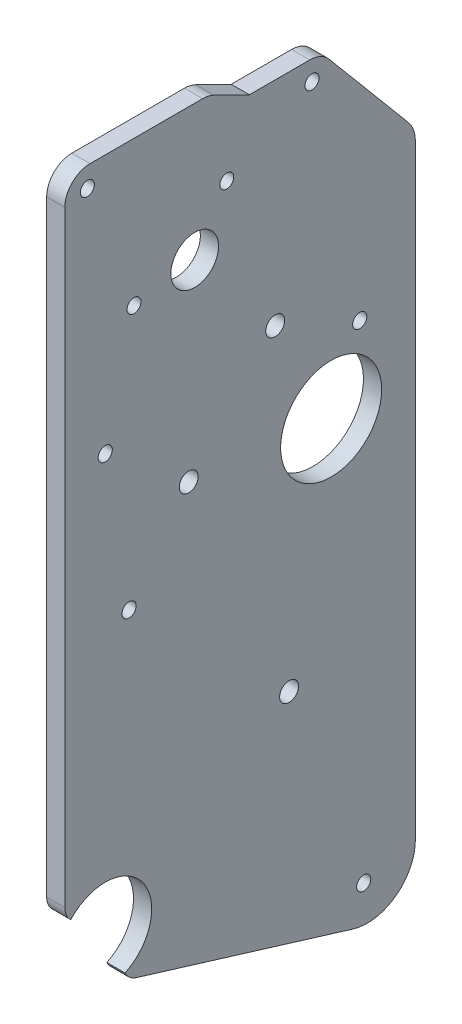
ISO-10303-21;
HEADER;
FILE_DESCRIPTION(('STEP AP214'),'2;1');
FILE_NAME('part.step','',(''),(''),'','','');
FILE_SCHEMA(('AUTOMOTIVE_DESIGN { 1 0 10303 214 1 1 1 1 }'));
ENDSEC;
DATA;
#1=APPLICATION_CONTEXT('core data for automotive mechanical design processes');
#2=APPLICATION_PROTOCOL_DEFINITION('international standard','automotive_design',2000,#1);
#3=PRODUCT_CONTEXT('',#1,'mechanical');
#4=PRODUCT('Part','Part','',(#3));
#5=PRODUCT_RELATED_PRODUCT_CATEGORY('part','',(#4));
#6=PRODUCT_DEFINITION_FORMATION('','',#4);
#7=PRODUCT_DEFINITION_CONTEXT('part definition',#1,'design');
#8=PRODUCT_DEFINITION('design','',#6,#7);
#9=PRODUCT_DEFINITION_SHAPE('','',#8);
#10=(LENGTH_UNIT() NAMED_UNIT(*) SI_UNIT(.MILLI.,.METRE.));
#11=(NAMED_UNIT(*) PLANE_ANGLE_UNIT() SI_UNIT($,.RADIAN.));
#12=(NAMED_UNIT(*) SI_UNIT($,.STERADIAN.) SOLID_ANGLE_UNIT());
#13=UNCERTAINTY_MEASURE_WITH_UNIT(LENGTH_MEASURE(1.E-05),#10,'distance_accuracy_value','');
#14=(GEOMETRIC_REPRESENTATION_CONTEXT(3) GLOBAL_UNCERTAINTY_ASSIGNED_CONTEXT((#13)) GLOBAL_UNIT_ASSIGNED_CONTEXT((#10,
#11,#12)) REPRESENTATION_CONTEXT('',''));
#15=CARTESIAN_POINT('',(0.,0.,0.));
#16=DIRECTION('',(0.,0.,1.));
#17=DIRECTION('',(1.,0.,0.));
#18=AXIS2_PLACEMENT_3D('',#15,#16,#17);
#19=CARTESIAN_POINT('',(-4.572,221.160370623668,290.181258716019));
#20=DIRECTION('',(1.,0.,0.));
#21=DIRECTION('',(0.,0.,-1.));
#22=AXIS2_PLACEMENT_3D('',#19,#20,#21);
#23=CYLINDRICAL_SURFACE('',#22,6.35000000000002);
#24=CARTESIAN_POINT('',(0.,221.160370623668,290.181258716019));
#25=DIRECTION('',(1.,0.,0.));
#26=DIRECTION('',(0.,0.,-1.));
#27=AXIS2_PLACEMENT_3D('',#24,#25,#26);
#28=CIRCLE('',#27,6.35000000000002);
#29=CARTESIAN_POINT('',(0.,227.510370623668,290.181258716019));
#30=VERTEX_POINT('',#29);
#31=CARTESIAN_POINT('',(0.,221.160370623668,296.531258716019));
#32=VERTEX_POINT('',#31);
#33=EDGE_CURVE('E172',#30,#32,#28,.T.);
#34=ORIENTED_EDGE('',*,*,#33,.F.);
#35=DIRECTION('',(1.,0.,0.));
#36=VECTOR('',#35,1.);
#37=CARTESIAN_POINT('',(-4.572,227.510370623668,290.181258716019));
#38=LINE('',#37,#36);
#39=CARTESIAN_POINT('',(-4.572,227.510370623668,290.181258716019));
#40=VERTEX_POINT('',#39);
#41=EDGE_CURVE('E11',#40,#30,#38,.T.);
#42=ORIENTED_EDGE('',*,*,#41,.F.);
#43=CARTESIAN_POINT('',(-4.572,221.160370623668,290.181258716019));
#44=DIRECTION('',(1.,0.,0.));
#45=DIRECTION('',(0.,0.,-1.));
#46=AXIS2_PLACEMENT_3D('',#43,#44,#45);
#47=CIRCLE('',#46,6.35000000000002);
#48=CARTESIAN_POINT('',(-4.572,221.160370623668,296.531258716019));
#49=VERTEX_POINT('',#48);
#50=EDGE_CURVE('E214',#40,#49,#47,.T.);
#51=ORIENTED_EDGE('',*,*,#50,.T.);
#52=DIRECTION('',(1.,0.,0.));
#53=VECTOR('',#52,1.);
#54=CARTESIAN_POINT('',(-4.572,221.160370623668,296.531258716019));
#55=LINE('',#54,#53);
#56=EDGE_CURVE('E36',#49,#32,#55,.T.);
#57=ORIENTED_EDGE('',*,*,#56,.T.);
#58=EDGE_LOOP('',(#34,#42,#51,#57));
#59=FACE_BOUND('',#58,.T.);
#60=ADVANCED_FACE('F33',(#59),#23,.T.);
#61=CARTESIAN_POINT('',(-4.572,227.510370623668,261.863679557986));
#62=DIRECTION('',(0.,1.,0.));
#63=DIRECTION('',(0.,0.,1.));
#64=AXIS2_PLACEMENT_3D('',#61,#62,#63);
#65=PLANE('',#64);
#66=DIRECTION('',(0.,0.,1.));
#67=VECTOR('',#66,1.);
#68=CARTESIAN_POINT('',(0.,227.510370623668,261.863679557986));
#69=LINE('',#68,#67);
#70=CARTESIAN_POINT('',(0.,227.510370623668,261.863679557986));
#71=VERTEX_POINT('',#70);
#72=EDGE_CURVE('E212',#71,#30,#69,.T.);
#73=ORIENTED_EDGE('',*,*,#72,.F.);
#74=DIRECTION('',(1.,0.,0.));
#75=VECTOR('',#74,1.);
#76=CARTESIAN_POINT('',(-4.572,227.510370623668,261.863679557986));
#77=LINE('',#76,#75);
#78=CARTESIAN_POINT('',(-4.572,227.510370623668,261.863679557986));
#79=VERTEX_POINT('',#78);
#80=EDGE_CURVE('E42',#79,#71,#77,.T.);
#81=ORIENTED_EDGE('',*,*,#80,.F.);
#82=DIRECTION('',(0.,0.,1.));
#83=VECTOR('',#82,1.);
#84=CARTESIAN_POINT('',(-4.572,227.510370623668,261.863679557986));
#85=LINE('',#84,#83);
#86=EDGE_CURVE('E162',#79,#40,#85,.T.);
#87=ORIENTED_EDGE('',*,*,#86,.T.);
#88=ORIENTED_EDGE('',*,*,#41,.T.);
#89=EDGE_LOOP('',(#73,#81,#87,#88));
#90=FACE_BOUND('',#89,.T.);
#91=ADVANCED_FACE('F240',(#90),#65,.T.);
#92=CARTESIAN_POINT('',(-4.572,221.160370623668,261.863679557986));
#93=DIRECTION('',(1.,0.,0.));
#94=DIRECTION('',(0.,0.,-1.));
#95=AXIS2_PLACEMENT_3D('',#92,#93,#94);
#96=CYLINDRICAL_SURFACE('',#95,6.35);
#97=CARTESIAN_POINT('',(0.,221.160370623668,261.863679557986));
#98=DIRECTION('',(1.,0.,0.));
#99=DIRECTION('',(0.,0.,-1.));
#100=AXIS2_PLACEMENT_3D('',#97,#98,#99);
#101=CIRCLE('',#100,6.35);
#102=CARTESIAN_POINT('',(0.,226.862369803877,259.069094553213));
#103=VERTEX_POINT('',#102);
#104=EDGE_CURVE('E149',#103,#71,#101,.T.);
#105=ORIENTED_EDGE('',*,*,#104,.F.);
#106=DIRECTION('',(1.,0.,0.));
#107=VECTOR('',#106,1.);
#108=CARTESIAN_POINT('',(-4.572,226.862369803877,259.069094553213));
#109=LINE('',#108,#107);
#110=CARTESIAN_POINT('',(-4.572,226.862369803877,259.069094553213));
#111=VERTEX_POINT('',#110);
#112=EDGE_CURVE('E144',#111,#103,#109,.T.);
#113=ORIENTED_EDGE('',*,*,#112,.F.);
#114=CARTESIAN_POINT('',(-4.572,221.160370623668,261.863679557986));
#115=DIRECTION('',(1.,0.,0.));
#116=DIRECTION('',(0.,0.,-1.));
#117=AXIS2_PLACEMENT_3D('',#114,#115,#116);
#118=CIRCLE('',#117,6.35);
#119=EDGE_CURVE('E147',#111,#79,#118,.T.);
#120=ORIENTED_EDGE('',*,*,#119,.T.);
#121=ORIENTED_EDGE('',*,*,#80,.T.);
#122=EDGE_LOOP('',(#105,#113,#120,#121));
#123=FACE_BOUND('',#122,.T.);
#124=ADVANCED_FACE('F146',(#123),#96,.T.);
#125=CARTESIAN_POINT('',(-4.572,222.476,250.119258716019));
#126=DIRECTION('',(0.,0.897952626804536,-0.440092126735793));
#127=DIRECTION('',(0.,0.440092126735793,0.897952626804536));
#128=AXIS2_PLACEMENT_3D('',#125,#126,#127);
#129=PLANE('',#128);
#130=DIRECTION('',(0.,0.440092126735793,0.897952626804536));
#131=VECTOR('',#130,1.);
#132=CARTESIAN_POINT('',(0.,222.476,250.119258716019));
#133=LINE('',#132,#131);
#134=CARTESIAN_POINT('',(0.,222.476,250.119258716019));
#135=VERTEX_POINT('',#134);
#136=EDGE_CURVE('E209',#135,#103,#133,.T.);
#137=ORIENTED_EDGE('',*,*,#136,.F.);
#138=DIRECTION('',(1.,0.,0.));
#139=VECTOR('',#138,1.);
#140=CARTESIAN_POINT('',(-4.572,222.476,250.119258716019));
#141=LINE('',#140,#139);
#142=CARTESIAN_POINT('',(-4.572,222.476,250.119258716019));
#143=VERTEX_POINT('',#142);
#144=EDGE_CURVE('E154',#143,#135,#141,.T.);
#145=ORIENTED_EDGE('',*,*,#144,.F.);
#146=DIRECTION('',(0.,0.440092126735793,0.897952626804536));
#147=VECTOR('',#146,1.);
#148=CARTESIAN_POINT('',(-4.572,222.476,250.119258716019));
#149=LINE('',#148,#147);
#150=EDGE_CURVE('E160',#143,#111,#149,.T.);
#151=ORIENTED_EDGE('',*,*,#150,.T.);
#152=ORIENTED_EDGE('',*,*,#112,.T.);
#153=EDGE_LOOP('',(#137,#145,#151,#152));
#154=FACE_BOUND('',#153,.T.);
#155=ADVANCED_FACE('F164',(#154),#129,.T.);
#156=CARTESIAN_POINT('',(-4.572,222.476,234.934629064233));
#157=DIRECTION('',(0.,1.,0.));
#158=DIRECTION('',(0.,0.,1.));
#159=AXIS2_PLACEMENT_3D('',#156,#157,#158);
#160=PLANE('',#159);
#161=DIRECTION('',(0.,0.,1.));
#162=VECTOR('',#161,1.);
#163=CARTESIAN_POINT('',(0.,222.476,234.934629064233));
#164=LINE('',#163,#162);
#165=CARTESIAN_POINT('',(0.,222.476,234.934629064233));
#166=VERTEX_POINT('',#165);
#167=EDGE_CURVE('E206',#166,#135,#164,.T.);
#168=ORIENTED_EDGE('',*,*,#167,.F.);
#169=DIRECTION('',(1.,0.,0.));
#170=VECTOR('',#169,1.);
#171=CARTESIAN_POINT('',(-4.572,222.476,234.934629064233));
#172=LINE('',#171,#170);
#173=CARTESIAN_POINT('',(-4.572,222.476,234.934629064233));
#174=VERTEX_POINT('',#173);
#175=EDGE_CURVE('E218',#174,#166,#172,.T.);
#176=ORIENTED_EDGE('',*,*,#175,.F.);
#177=DIRECTION('',(0.,0.,1.));
#178=VECTOR('',#177,1.);
#179=CARTESIAN_POINT('',(-4.572,222.476,234.934629064233));
#180=LINE('',#179,#178);
#181=EDGE_CURVE('E165',#174,#143,#180,.T.);
#182=ORIENTED_EDGE('',*,*,#181,.T.);
#183=ORIENTED_EDGE('',*,*,#144,.T.);
#184=EDGE_LOOP('',(#168,#176,#182,#183));
#185=FACE_BOUND('',#184,.T.);
#186=ADVANCED_FACE('F253',(#185),#160,.T.);
#187=CARTESIAN_POINT('',(-4.572,216.126,234.934629064233));
#188=DIRECTION('',(1.,0.,0.));
#189=DIRECTION('',(0.,0.,-1.));
#190=AXIS2_PLACEMENT_3D('',#187,#188,#189);
#191=CYLINDRICAL_SURFACE('',#190,6.35);
#192=CARTESIAN_POINT('',(0.,216.126,234.934629064233));
#193=DIRECTION('',(1.,0.,0.));
#194=DIRECTION('',(0.,0.,-1.));
#195=AXIS2_PLACEMENT_3D('',#192,#193,#194);
#196=CIRCLE('',#195,6.35);
#197=CARTESIAN_POINT('',(0.,220.207701321509,230.070246850427));
#198=VERTEX_POINT('',#197);
#199=EDGE_CURVE('E203',#198,#166,#196,.T.);
#200=ORIENTED_EDGE('',*,*,#199,.F.);
#201=DIRECTION('',(1.,0.,0.));
#202=VECTOR('',#201,1.);
#203=CARTESIAN_POINT('',(-4.572,220.207701321509,230.070246850427));
#204=LINE('',#203,#202);
#205=CARTESIAN_POINT('',(-4.572,220.207701321509,230.070246850427));
#206=VERTEX_POINT('',#205);
#207=EDGE_CURVE('E220',#206,#198,#204,.T.);
#208=ORIENTED_EDGE('',*,*,#207,.F.);
#209=CARTESIAN_POINT('',(-4.572,216.126,234.934629064233));
#210=DIRECTION('',(1.,0.,0.));
#211=DIRECTION('',(0.,0.,-1.));
#212=AXIS2_PLACEMENT_3D('',#209,#210,#211);
#213=CIRCLE('',#212,6.35);
#214=EDGE_CURVE('E167',#206,#174,#213,.T.);
#215=ORIENTED_EDGE('',*,*,#214,.T.);
#216=ORIENTED_EDGE('',*,*,#175,.T.);
#217=EDGE_LOOP('',(#200,#208,#215,#216));
#218=FACE_BOUND('',#217,.T.);
#219=ADVANCED_FACE('F256',(#218),#191,.T.);
#220=CARTESIAN_POINT('',(-4.572,196.486537353322,210.165826913626));
#221=DIRECTION('',(0.,0.642787609686538,-0.766044443118979));
#222=DIRECTION('',(0.,0.766044443118979,0.642787609686538));
#223=AXIS2_PLACEMENT_3D('',#220,#221,#222);
#224=PLANE('',#223);
#225=DIRECTION('',(0.,0.766044443118979,0.642787609686538));
#226=VECTOR('',#225,1.);
#227=CARTESIAN_POINT('',(0.,196.486537353322,210.165826913626));
#228=LINE('',#227,#226);
#229=CARTESIAN_POINT('',(0.,196.486537353322,210.165826913626));
#230=VERTEX_POINT('',#229);
#231=EDGE_CURVE('E200',#230,#198,#228,.T.);
#232=ORIENTED_EDGE('',*,*,#231,.F.);
#233=DIRECTION('',(1.,0.,0.));
#234=VECTOR('',#233,1.);
#235=CARTESIAN_POINT('',(-4.572,196.486537353322,210.165826913626));
#236=LINE('',#235,#234);
#237=CARTESIAN_POINT('',(-4.572,196.486537353322,210.165826913626));
#238=VERTEX_POINT('',#237);
#239=EDGE_CURVE('E222',#238,#230,#236,.T.);
#240=ORIENTED_EDGE('',*,*,#239,.F.);
#241=DIRECTION('',(0.,0.766044443118979,0.642787609686538));
#242=VECTOR('',#241,1.);
#243=CARTESIAN_POINT('',(-4.572,196.486537353322,210.165826913626));
#244=LINE('',#243,#242);
#245=EDGE_CURVE('E461',#238,#206,#244,.T.);
#246=ORIENTED_EDGE('',*,*,#245,.T.);
#247=ORIENTED_EDGE('',*,*,#207,.T.);
#248=EDGE_LOOP('',(#232,#240,#246,#247));
#249=FACE_BOUND('',#248,.T.);
#250=ADVANCED_FACE('F260',(#249),#224,.T.);
#251=CARTESIAN_POINT('',(-4.572,191.588495767511,216.003085570192));
#252=DIRECTION('',(1.,0.,0.));
#253=DIRECTION('',(0.,0.,-1.));
#254=AXIS2_PLACEMENT_3D('',#251,#252,#253);
#255=CYLINDRICAL_SURFACE('',#254,7.61999999999999);
#256=CARTESIAN_POINT('',(0.,191.588495767511,216.003085570192));
#257=DIRECTION('',(1.,0.,0.));
#258=DIRECTION('',(0.,0.,-1.));
#259=AXIS2_PLACEMENT_3D('',#256,#257,#258);
#260=CIRCLE('',#259,7.61999999999999);
#261=CARTESIAN_POINT('',(0.,191.588495767511,208.383085570192));
#262=VERTEX_POINT('',#261);
#263=EDGE_CURVE('E197',#262,#230,#260,.T.);
#264=ORIENTED_EDGE('',*,*,#263,.F.);
#265=DIRECTION('',(1.,0.,0.));
#266=VECTOR('',#265,1.);
#267=CARTESIAN_POINT('',(-4.572,191.588495767511,208.383085570192));
#268=LINE('',#267,#266);
#269=CARTESIAN_POINT('',(-4.572,191.588495767511,208.383085570192));
#270=VERTEX_POINT('',#269);
#271=EDGE_CURVE('E224',#270,#262,#268,.T.);
#272=ORIENTED_EDGE('',*,*,#271,.F.);
#273=CARTESIAN_POINT('',(-4.572,191.588495767511,216.003085570192));
#274=DIRECTION('',(1.,0.,0.));
#275=DIRECTION('',(0.,0.,-1.));
#276=AXIS2_PLACEMENT_3D('',#273,#274,#275);
#277=CIRCLE('',#276,7.61999999999999);
#278=EDGE_CURVE('E458',#270,#238,#277,.T.);
#279=ORIENTED_EDGE('',*,*,#278,.T.);
#280=ORIENTED_EDGE('',*,*,#239,.T.);
#281=EDGE_LOOP('',(#264,#272,#279,#280));
#282=FACE_BOUND('',#281,.T.);
#283=ADVANCED_FACE('F264',(#282),#255,.T.);
#284=CARTESIAN_POINT('',(-4.572,191.588495767511,208.383085570192));
#285=DIRECTION('',(0.,0.,-1.));
#286=DIRECTION('',(-1.,0.,0.));
#287=AXIS2_PLACEMENT_3D('',#284,#285,#286);
#288=PLANE('',#287);
#289=DIRECTION('',(0.,1.,0.));
#290=VECTOR('',#289,1.);
#291=CARTESIAN_POINT('',(0.,191.588495767511,208.383085570192));
#292=LINE('',#291,#290);
#293=CARTESIAN_POINT('',(0.,39.3250107437139,208.383085570192));
#294=VERTEX_POINT('',#293);
#295=EDGE_CURVE('E194',#294,#262,#292,.T.);
#296=ORIENTED_EDGE('',*,*,#295,.F.);
#297=DIRECTION('',(1.,0.,0.));
#298=VECTOR('',#297,1.);
#299=CARTESIAN_POINT('',(-4.572,39.3250107437139,208.383085570192));
#300=LINE('',#299,#298);
#301=CARTESIAN_POINT('',(-4.572,39.3250107437139,208.383085570192));
#302=VERTEX_POINT('',#301);
#303=EDGE_CURVE('E226',#302,#294,#300,.T.);
#304=ORIENTED_EDGE('',*,*,#303,.F.);
#305=DIRECTION('',(0.,1.,0.));
#306=VECTOR('',#305,1.);
#307=CARTESIAN_POINT('',(-4.572,191.588495767511,208.383085570192));
#308=LINE('',#307,#306);
#309=EDGE_CURVE('E455',#302,#270,#308,.T.);
#310=ORIENTED_EDGE('',*,*,#309,.T.);
#311=ORIENTED_EDGE('',*,*,#271,.T.);
#312=EDGE_LOOP('',(#296,#304,#310,#311));
#313=FACE_BOUND('',#312,.T.);
#314=ADVANCED_FACE('F268',(#313),#288,.T.);
#315=CARTESIAN_POINT('',(-4.572,39.3250107437139,220.486517559756));
#316=DIRECTION('',(1.,0.,0.));
#317=DIRECTION('',(0.,0.,-1.));
#318=AXIS2_PLACEMENT_3D('',#315,#316,#317);
#319=CYLINDRICAL_SURFACE('',#318,12.1034319895634);
#320=CARTESIAN_POINT('',(0.,39.3250107437139,220.486517559756));
#321=DIRECTION('',(1.,0.,0.));
#322=DIRECTION('',(0.,0.,1.));
#323=AXIS2_PLACEMENT_3D('',#320,#321,#322);
#324=CIRCLE('',#323,12.1034319895634);
#325=CARTESIAN_POINT('',(0.,27.7501738366427,224.024344081886));
#326=VERTEX_POINT('',#325);
#327=EDGE_CURVE('E191',#326,#294,#324,.T.);
#328=ORIENTED_EDGE('',*,*,#327,.F.);
#329=DIRECTION('',(1.,0.,0.));
#330=VECTOR('',#329,1.);
#331=CARTESIAN_POINT('',(-4.572,27.7501738366427,224.024344081886));
#332=LINE('',#331,#330);
#333=CARTESIAN_POINT('',(-4.572,27.7501738366427,224.024344081886));
#334=VERTEX_POINT('',#333);
#335=EDGE_CURVE('E228',#334,#326,#332,.T.);
#336=ORIENTED_EDGE('',*,*,#335,.F.);
#337=CARTESIAN_POINT('',(-4.572,39.3250107437139,220.486517559756));
#338=DIRECTION('',(1.,0.,0.));
#339=DIRECTION('',(0.,0.,1.));
#340=AXIS2_PLACEMENT_3D('',#337,#338,#339);
#341=CIRCLE('',#340,12.1034319895634);
#342=EDGE_CURVE('E452',#334,#302,#341,.T.);
#343=ORIENTED_EDGE('',*,*,#342,.T.);
#344=ORIENTED_EDGE('',*,*,#303,.T.);
#345=EDGE_LOOP('',(#328,#336,#343,#344));
#346=FACE_BOUND('',#345,.T.);
#347=ADVANCED_FACE('F272',(#346),#319,.T.);
#348=CARTESIAN_POINT('',(-4.572,44.4305209401072,278.598048040575));
#349=DIRECTION('',(0.,-0.956326843250082,0.292299450699678));
#350=DIRECTION('',(0.,-0.292299450699678,-0.956326843250082));
#351=AXIS2_PLACEMENT_3D('',#348,#349,#350);
#352=PLANE('',#351);
#353=DIRECTION('',(0.,-0.292299450699678,-0.956326843250082));
#354=VECTOR('',#353,1.);
#355=CARTESIAN_POINT('',(0.,44.4305209401072,278.598048040575));
#356=LINE('',#355,#354);
#357=CARTESIAN_POINT('',(0.,44.4305209401072,278.598048040575));
#358=VERTEX_POINT('',#357);
#359=EDGE_CURVE('E188',#358,#326,#356,.T.);
#360=ORIENTED_EDGE('',*,*,#359,.F.);
#361=DIRECTION('',(1.,0.,0.));
#362=VECTOR('',#361,1.);
#363=CARTESIAN_POINT('',(-4.572,44.4305209401072,278.598048040575));
#364=LINE('',#363,#362);
#365=CARTESIAN_POINT('',(-4.572,44.4305209401072,278.598048040575));
#366=VERTEX_POINT('',#365);
#367=EDGE_CURVE('E230',#366,#358,#364,.T.);
#368=ORIENTED_EDGE('',*,*,#367,.F.);
#369=DIRECTION('',(0.,-0.292299450699678,-0.956326843250082));
#370=VECTOR('',#369,1.);
#371=CARTESIAN_POINT('',(-4.572,44.4305209401072,278.598048040575));
#372=LINE('',#371,#370);
#373=EDGE_CURVE('E449',#366,#334,#372,.T.);
#374=ORIENTED_EDGE('',*,*,#373,.T.);
#375=ORIENTED_EDGE('',*,*,#335,.T.);
#376=EDGE_LOOP('',(#360,#368,#374,#375));
#377=FACE_BOUND('',#376,.T.);
#378=ADVANCED_FACE('F276',(#377),#352,.T.);
#379=CARTESIAN_POINT('',(-4.572,48.8028472674466,277.261654951977));
#380=DIRECTION('',(1.,0.,0.));
#381=DIRECTION('',(0.,0.,-1.));
#382=AXIS2_PLACEMENT_3D('',#379,#380,#381);
#383=CYLINDRICAL_SURFACE('',#382,4.57199999999996);
#384=CARTESIAN_POINT('',(0.,48.8028472674466,277.261654951977));
#385=DIRECTION('',(1.,0.,0.));
#386=DIRECTION('',(0.,0.,1.));
#387=AXIS2_PLACEMENT_3D('',#384,#385,#386);
#388=CIRCLE('',#387,4.57199999999996);
#389=CARTESIAN_POINT('',(0.,46.8571774521959,281.398991410378));
#390=VERTEX_POINT('',#389);
#391=EDGE_CURVE('E185',#390,#358,#388,.T.);
#392=ORIENTED_EDGE('',*,*,#391,.F.);
#393=DIRECTION('',(1.,0.,0.));
#394=VECTOR('',#393,1.);
#395=CARTESIAN_POINT('',(-4.572,46.8571774521959,281.398991410378));
#396=LINE('',#395,#394);
#397=CARTESIAN_POINT('',(-4.572,46.8571774521959,281.398991410378));
#398=VERTEX_POINT('',#397);
#399=EDGE_CURVE('E232',#398,#390,#396,.T.);
#400=ORIENTED_EDGE('',*,*,#399,.F.);
#401=CARTESIAN_POINT('',(-4.572,48.8028472674466,277.261654951977));
#402=DIRECTION('',(1.,0.,0.));
#403=DIRECTION('',(0.,0.,1.));
#404=AXIS2_PLACEMENT_3D('',#401,#402,#403);
#405=CIRCLE('',#404,4.57199999999996);
#406=EDGE_CURVE('E446',#398,#366,#405,.T.);
#407=ORIENTED_EDGE('',*,*,#406,.T.);
#408=ORIENTED_EDGE('',*,*,#367,.T.);
#409=EDGE_LOOP('',(#392,#400,#407,#408));
#410=FACE_BOUND('',#409,.T.);
#411=ADVANCED_FACE('F280',(#410),#383,.T.);
#412=CARTESIAN_POINT('',(-4.572,57.4303706236677,286.371258716019));
#413=DIRECTION('',(1.,0.,0.));
#414=DIRECTION('',(0.,0.,-1.));
#415=AXIS2_PLACEMENT_3D('',#412,#413,#414);
#416=CYLINDRICAL_SURFACE('',#415,11.684);
#417=CARTESIAN_POINT('',(0.,57.4303706236677,286.371258716019));
#418=DIRECTION('',(-1.,0.,0.));
#419=DIRECTION('',(0.,0.,-1.));
#420=AXIS2_PLACEMENT_3D('',#417,#418,#419);
#421=CIRCLE('',#420,11.684);
#422=CARTESIAN_POINT('',(0.,65.2760218760293,295.029296162595));
#423=VERTEX_POINT('',#422);
#424=EDGE_CURVE('E182',#423,#390,#421,.T.);
#425=ORIENTED_EDGE('',*,*,#424,.F.);
#426=DIRECTION('',(1.,0.,0.));
#427=VECTOR('',#426,1.);
#428=CARTESIAN_POINT('',(-4.572,65.2760218760293,295.029296162595));
#429=LINE('',#428,#427);
#430=CARTESIAN_POINT('',(-4.572,65.2760218760293,295.029296162595));
#431=VERTEX_POINT('',#430);
#432=EDGE_CURVE('E234',#431,#423,#429,.T.);
#433=ORIENTED_EDGE('',*,*,#432,.F.);
#434=CARTESIAN_POINT('',(-4.572,57.4303706236677,286.371258716019));
#435=DIRECTION('',(-1.,0.,0.));
#436=DIRECTION('',(0.,0.,-1.));
#437=AXIS2_PLACEMENT_3D('',#434,#435,#436);
#438=CIRCLE('',#437,11.684);
#439=EDGE_CURVE('E443',#431,#398,#438,.T.);
#440=ORIENTED_EDGE('',*,*,#439,.T.);
#441=ORIENTED_EDGE('',*,*,#399,.T.);
#442=EDGE_LOOP('',(#425,#433,#440,#441));
#443=FACE_BOUND('',#442,.T.);
#444=ADVANCED_FACE('F284',(#443),#416,.F.);
#445=CARTESIAN_POINT('',(-4.572,68.6639495725156,291.959258716019));
#446=DIRECTION('',(1.,0.,0.));
#447=DIRECTION('',(0.,0.,-1.));
#448=AXIS2_PLACEMENT_3D('',#445,#446,#447);
#449=CYLINDRICAL_SURFACE('',#448,4.57199999999994);
#450=CARTESIAN_POINT('',(0.,68.6639495725156,291.959258716019));
#451=DIRECTION('',(1.,0.,0.));
#452=DIRECTION('',(0.,0.,1.));
#453=AXIS2_PLACEMENT_3D('',#450,#451,#452);
#454=CIRCLE('',#453,4.57199999999994);
#455=CARTESIAN_POINT('',(0.,68.6639495725156,296.531258716019));
#456=VERTEX_POINT('',#455);
#457=EDGE_CURVE('E179',#456,#423,#454,.T.);
#458=ORIENTED_EDGE('',*,*,#457,.F.);
#459=DIRECTION('',(1.,0.,0.));
#460=VECTOR('',#459,1.);
#461=CARTESIAN_POINT('',(-4.572,68.6639495725156,296.531258716019));
#462=LINE('',#461,#460);
#463=CARTESIAN_POINT('',(-4.572,68.6639495725156,296.531258716019));
#464=VERTEX_POINT('',#463);
#465=EDGE_CURVE('E235',#464,#456,#462,.T.);
#466=ORIENTED_EDGE('',*,*,#465,.F.);
#467=CARTESIAN_POINT('',(-4.572,68.6639495725156,291.959258716019));
#468=DIRECTION('',(1.,0.,0.));
#469=DIRECTION('',(0.,0.,1.));
#470=AXIS2_PLACEMENT_3D('',#467,#468,#469);
#471=CIRCLE('',#470,4.57199999999994);
#472=EDGE_CURVE('E440',#464,#431,#471,.T.);
#473=ORIENTED_EDGE('',*,*,#472,.T.);
#474=ORIENTED_EDGE('',*,*,#432,.T.);
#475=EDGE_LOOP('',(#458,#466,#473,#474));
#476=FACE_BOUND('',#475,.T.);
#477=ADVANCED_FACE('F288',(#476),#449,.T.);
#478=CARTESIAN_POINT('',(-4.572,221.160370623668,296.531258716019));
#479=DIRECTION('',(0.,0.,1.));
#480=DIRECTION('',(1.,0.,0.));
#481=AXIS2_PLACEMENT_3D('',#478,#479,#480);
#482=PLANE('',#481);
#483=DIRECTION('',(0.,-1.,0.));
#484=VECTOR('',#483,1.);
#485=CARTESIAN_POINT('',(0.,221.160370623668,296.531258716019));
#486=LINE('',#485,#484);
#487=EDGE_CURVE('E175',#32,#456,#486,.T.);
#488=ORIENTED_EDGE('',*,*,#487,.F.);
#489=ORIENTED_EDGE('',*,*,#56,.F.);
#490=DIRECTION('',(0.,-1.,0.));
#491=VECTOR('',#490,1.);
#492=CARTESIAN_POINT('',(-4.572,221.160370623668,296.531258716019));
#493=LINE('',#492,#491);
#494=EDGE_CURVE('E438',#49,#464,#493,.T.);
#495=ORIENTED_EDGE('',*,*,#494,.T.);
#496=ORIENTED_EDGE('',*,*,#465,.T.);
#497=EDGE_LOOP('',(#488,#489,#495,#496));
#498=FACE_BOUND('',#497,.T.);
#499=ADVANCED_FACE('F237',(#498),#482,.T.);
#500=CARTESIAN_POINT('',(-4.572,221.160370623668,290.181258716019));
#501=DIRECTION('',(1.,0.,0.));
#502=DIRECTION('',(0.,0.,-1.));
#503=AXIS2_PLACEMENT_3D('',#500,#501,#502);
#504=PLANE('',#503);
#505=CARTESIAN_POINT('',(-4.572,168.931188955137,243.629318942276));
#506=DIRECTION('',(1.,0.,0.));
#507=DIRECTION('',(0.,0.,-1.));
#508=AXIS2_PLACEMENT_3D('',#505,#506,#507);
#509=CIRCLE('',#508,2.38125);
#510=CARTESIAN_POINT('',(-4.572,168.931188955137,241.248068942276));
#511=VERTEX_POINT('',#510);
#512=EDGE_CURVE('E359',#511,#511,#509,.T.);
#513=ORIENTED_EDGE('',*,*,#512,.T.);
#514=EDGE_LOOP('',(#513));
#515=FACE_BOUND('',#514,.T.);
#516=CARTESIAN_POINT('',(-4.572,87.5182008175713,240.133085570192));
#517=DIRECTION('',(1.,0.,0.));
#518=DIRECTION('',(0.,0.,-1.));
#519=AXIS2_PLACEMENT_3D('',#516,#517,#518);
#520=CIRCLE('',#519,2.38125);
#521=CARTESIAN_POINT('',(-4.572,87.5182008175713,237.751835570192));
#522=VERTEX_POINT('',#521);
#523=EDGE_CURVE('E367',#522,#522,#520,.T.);
#524=ORIENTED_EDGE('',*,*,#523,.T.);
#525=EDGE_LOOP('',(#524));
#526=FACE_BOUND('',#525,.T.);
#527=CARTESIAN_POINT('',(-4.572,145.789251151916,265.366688026685));
#528=DIRECTION('',(1.,0.,0.));
#529=DIRECTION('',(0.,0.,-1.));
#530=AXIS2_PLACEMENT_3D('',#527,#528,#529);
#531=CIRCLE('',#530,2.38125);
#532=CARTESIAN_POINT('',(-4.572,145.789251151916,262.985438026685));
#533=VERTEX_POINT('',#532);
#534=EDGE_CURVE('E373',#533,#533,#531,.T.);
#535=ORIENTED_EDGE('',*,*,#534,.T.);
#536=EDGE_LOOP('',(#535));
#537=FACE_BOUND('',#536,.T.);
#538=CARTESIAN_POINT('',(-4.572,159.430370623668,222.371258716019));
#539=DIRECTION('',(1.,0.,0.));
#540=DIRECTION('',(0.,0.,-1.));
#541=AXIS2_PLACEMENT_3D('',#538,#539,#540);
#542=CIRCLE('',#541,1.778);
#543=CARTESIAN_POINT('',(-4.572,159.430370623668,220.593258716019));
#544=VERTEX_POINT('',#543);
#545=EDGE_CURVE('E379',#544,#544,#542,.T.);
#546=ORIENTED_EDGE('',*,*,#545,.T.);
#547=EDGE_LOOP('',(#546));
#548=FACE_BOUND('',#547,.T.);
#549=CARTESIAN_POINT('',(-4.572,217.430370623668,234.371258716019));
#550=DIRECTION('',(1.,0.,0.));
#551=DIRECTION('',(0.,0.,-1.));
#552=AXIS2_PLACEMENT_3D('',#549,#550,#551);
#553=CIRCLE('',#552,1.778);
#554=CARTESIAN_POINT('',(-4.572,217.430370623668,232.593258716019));
#555=VERTEX_POINT('',#554);
#556=EDGE_CURVE('E385',#555,#555,#553,.T.);
#557=ORIENTED_EDGE('',*,*,#556,.T.);
#558=EDGE_LOOP('',(#557));
#559=FACE_BOUND('',#558,.T.);
#560=CARTESIAN_POINT('',(-4.572,222.430370623668,290.871258716019));
#561=DIRECTION('',(1.,0.,0.));
#562=DIRECTION('',(0.,0.,-1.));
#563=AXIS2_PLACEMENT_3D('',#560,#561,#562);
#564=CIRCLE('',#563,1.77799999999998);
#565=CARTESIAN_POINT('',(-4.572,222.430370623668,289.093258716019));
#566=VERTEX_POINT('',#565);
#567=EDGE_CURVE('E391',#566,#566,#564,.T.);
#568=ORIENTED_EDGE('',*,*,#567,.T.);
#569=EDGE_LOOP('',(#568));
#570=FACE_BOUND('',#569,.T.);
#571=CARTESIAN_POINT('',(-4.572,193.390808463346,263.872577413024));
#572=DIRECTION('',(1.,0.,0.));
#573=DIRECTION('',(0.,0.,-1.));
#574=AXIS2_PLACEMENT_3D('',#571,#572,#573);
#575=CIRCLE('',#574,6.00000000000004);
#576=CARTESIAN_POINT('',(-4.572,193.390808463346,257.872577413024));
#577=VERTEX_POINT('',#576);
#578=EDGE_CURVE('E397',#577,#577,#575,.T.);
#579=ORIENTED_EDGE('',*,*,#578,.T.);
#580=EDGE_LOOP('',(#579));
#581=FACE_BOUND('',#580,.T.);
#582=CARTESIAN_POINT('',(-4.572,191.06840303024,279.132211517559));
#583=DIRECTION('',(1.,0.,0.));
#584=DIRECTION('',(0.,0.,-1.));
#585=AXIS2_PLACEMENT_3D('',#582,#583,#584);
#586=CIRCLE('',#585,1.74999999999998);
#587=CARTESIAN_POINT('',(-4.572,191.06840303024,277.382211517559));
#588=VERTEX_POINT('',#587);
#589=EDGE_CURVE('E403',#588,#588,#586,.T.);
#590=ORIENTED_EDGE('',*,*,#589,.T.);
#591=EDGE_LOOP('',(#590));
#592=FACE_BOUND('',#591,.T.);
#593=CARTESIAN_POINT('',(-4.572,206.546414937072,255.799163122375));
#594=DIRECTION('',(1.,0.,0.));
#595=DIRECTION('',(0.,0.,-1.));
#596=AXIS2_PLACEMENT_3D('',#593,#594,#595);
#597=CIRCLE('',#596,1.74999999999998);
#598=CARTESIAN_POINT('',(-4.572,206.546414937072,254.049163122375));
#599=VERTEX_POINT('',#598);
#600=EDGE_CURVE('E409',#599,#599,#597,.T.);
#601=ORIENTED_EDGE('',*,*,#600,.T.);
#602=EDGE_LOOP('',(#601));
#603=FACE_BOUND('',#602,.T.);
#604=CARTESIAN_POINT('',(-4.572,162.430370623668,286.371258716019));
#605=DIRECTION('',(1.,0.,0.));
#606=DIRECTION('',(0.,0.,-1.));
#607=AXIS2_PLACEMENT_3D('',#604,#605,#606);
#608=CIRCLE('',#607,1.77799999999998);
#609=CARTESIAN_POINT('',(-4.572,162.430370623668,284.593258716019));
#610=VERTEX_POINT('',#609);
#611=EDGE_CURVE('E415',#610,#610,#608,.T.);
#612=ORIENTED_EDGE('',*,*,#611,.T.);
#613=EDGE_LOOP('',(#612));
#614=FACE_BOUND('',#613,.T.);
#615=CARTESIAN_POINT('',(-4.572,125.430370623668,280.371258716019));
#616=DIRECTION('',(1.,0.,0.));
#617=DIRECTION('',(0.,0.,-1.));
#618=AXIS2_PLACEMENT_3D('',#615,#616,#617);
#619=CIRCLE('',#618,1.77799999999998);
#620=CARTESIAN_POINT('',(-4.572,125.430370623668,278.593258716019));
#621=VERTEX_POINT('',#620);
#622=EDGE_CURVE('E421',#621,#621,#619,.T.);
#623=ORIENTED_EDGE('',*,*,#622,.T.);
#624=EDGE_LOOP('',(#623));
#625=FACE_BOUND('',#624,.T.);
#626=CARTESIAN_POINT('',(-4.572,141.66058799526,229.557259723391));
#627=DIRECTION('',(1.,0.,0.));
#628=DIRECTION('',(0.,0.,-1.));
#629=AXIS2_PLACEMENT_3D('',#626,#627,#628);
#630=CIRCLE('',#629,12.7);
#631=CARTESIAN_POINT('',(-4.572,141.66058799526,216.857259723391));
#632=VERTEX_POINT('',#631);
#633=EDGE_CURVE('E427',#632,#632,#630,.T.);
#634=ORIENTED_EDGE('',*,*,#633,.T.);
#635=EDGE_LOOP('',(#634));
#636=FACE_BOUND('',#635,.T.);
#637=CARTESIAN_POINT('',(-4.572,36.4303706236677,221.371258716019));
#638=DIRECTION('',(1.,0.,0.));
#639=DIRECTION('',(0.,0.,-1.));
#640=AXIS2_PLACEMENT_3D('',#637,#638,#639);
#641=CIRCLE('',#640,1.77800000000001);
#642=CARTESIAN_POINT('',(-4.572,36.4303706236677,219.593258716019));
#643=VERTEX_POINT('',#642);
#644=EDGE_CURVE('E176',#643,#643,#641,.T.);
#645=ORIENTED_EDGE('',*,*,#644,.T.);
#646=EDGE_LOOP('',(#645));
#647=FACE_BOUND('',#646,.T.);
#648=ORIENTED_EDGE('',*,*,#50,.F.);
#649=ORIENTED_EDGE('',*,*,#86,.F.);
#650=ORIENTED_EDGE('',*,*,#119,.F.);
#651=ORIENTED_EDGE('',*,*,#150,.F.);
#652=ORIENTED_EDGE('',*,*,#181,.F.);
#653=ORIENTED_EDGE('',*,*,#214,.F.);
#654=ORIENTED_EDGE('',*,*,#245,.F.);
#655=ORIENTED_EDGE('',*,*,#278,.F.);
#656=ORIENTED_EDGE('',*,*,#309,.F.);
#657=ORIENTED_EDGE('',*,*,#342,.F.);
#658=ORIENTED_EDGE('',*,*,#373,.F.);
#659=ORIENTED_EDGE('',*,*,#406,.F.);
#660=ORIENTED_EDGE('',*,*,#439,.F.);
#661=ORIENTED_EDGE('',*,*,#472,.F.);
#662=ORIENTED_EDGE('',*,*,#494,.F.);
#663=EDGE_LOOP('',(#648,#649,#650,#651,#652,#653,#654,#655,#656,#657,#658,#659,#660,#661,#662));
#664=FACE_BOUND('',#663,.T.);
#665=ADVANCED_FACE('F158',(#515,#526,#537,#548,#559,#570,#581,#592,#603,#614,#625,#636,#647,
#664),#504,.F.);
#666=CARTESIAN_POINT('',(0.,221.160370623668,290.181258716019));
#667=DIRECTION('',(1.,0.,0.));
#668=DIRECTION('',(0.,0.,-1.));
#669=AXIS2_PLACEMENT_3D('',#666,#667,#668);
#670=PLANE('',#669);
#671=CARTESIAN_POINT('',(0.,168.931188955137,243.629318942276));
#672=DIRECTION('',(1.,0.,0.));
#673=DIRECTION('',(0.,0.,-1.));
#674=AXIS2_PLACEMENT_3D('',#671,#672,#673);
#675=CIRCLE('',#674,2.38125);
#676=CARTESIAN_POINT('',(0.,168.931188955137,241.248068942276));
#677=VERTEX_POINT('',#676);
#678=EDGE_CURVE('E362',#677,#677,#675,.T.);
#679=ORIENTED_EDGE('',*,*,#678,.F.);
#680=EDGE_LOOP('',(#679));
#681=FACE_BOUND('',#680,.T.);
#682=CARTESIAN_POINT('',(0.,87.5182008175713,240.133085570192));
#683=DIRECTION('',(1.,0.,0.));
#684=DIRECTION('',(0.,0.,-1.));
#685=AXIS2_PLACEMENT_3D('',#682,#683,#684);
#686=CIRCLE('',#685,2.38125);
#687=CARTESIAN_POINT('',(0.,87.5182008175713,237.751835570192));
#688=VERTEX_POINT('',#687);
#689=EDGE_CURVE('E364',#688,#688,#686,.T.);
#690=ORIENTED_EDGE('',*,*,#689,.F.);
#691=EDGE_LOOP('',(#690));
#692=FACE_BOUND('',#691,.T.);
#693=CARTESIAN_POINT('',(0.,145.789251151916,265.366688026685));
#694=DIRECTION('',(1.,0.,0.));
#695=DIRECTION('',(0.,0.,-1.));
#696=AXIS2_PLACEMENT_3D('',#693,#694,#695);
#697=CIRCLE('',#696,2.38125);
#698=CARTESIAN_POINT('',(0.,145.789251151916,262.985438026685));
#699=VERTEX_POINT('',#698);
#700=EDGE_CURVE('E370',#699,#699,#697,.T.);
#701=ORIENTED_EDGE('',*,*,#700,.F.);
#702=EDGE_LOOP('',(#701));
#703=FACE_BOUND('',#702,.T.);
#704=CARTESIAN_POINT('',(0.,159.430370623668,222.371258716019));
#705=DIRECTION('',(1.,0.,0.));
#706=DIRECTION('',(0.,0.,-1.));
#707=AXIS2_PLACEMENT_3D('',#704,#705,#706);
#708=CIRCLE('',#707,1.778);
#709=CARTESIAN_POINT('',(0.,159.430370623668,220.593258716019));
#710=VERTEX_POINT('',#709);
#711=EDGE_CURVE('E376',#710,#710,#708,.T.);
#712=ORIENTED_EDGE('',*,*,#711,.F.);
#713=EDGE_LOOP('',(#712));
#714=FACE_BOUND('',#713,.T.);
#715=CARTESIAN_POINT('',(0.,217.430370623668,234.371258716019));
#716=DIRECTION('',(1.,0.,0.));
#717=DIRECTION('',(0.,0.,-1.));
#718=AXIS2_PLACEMENT_3D('',#715,#716,#717);
#719=CIRCLE('',#718,1.778);
#720=CARTESIAN_POINT('',(0.,217.430370623668,232.593258716019));
#721=VERTEX_POINT('',#720);
#722=EDGE_CURVE('E382',#721,#721,#719,.T.);
#723=ORIENTED_EDGE('',*,*,#722,.F.);
#724=EDGE_LOOP('',(#723));
#725=FACE_BOUND('',#724,.T.);
#726=CARTESIAN_POINT('',(0.,222.430370623668,290.871258716019));
#727=DIRECTION('',(1.,0.,0.));
#728=DIRECTION('',(0.,0.,-1.));
#729=AXIS2_PLACEMENT_3D('',#726,#727,#728);
#730=CIRCLE('',#729,1.77799999999998);
#731=CARTESIAN_POINT('',(0.,222.430370623668,289.093258716019));
#732=VERTEX_POINT('',#731);
#733=EDGE_CURVE('E388',#732,#732,#730,.T.);
#734=ORIENTED_EDGE('',*,*,#733,.F.);
#735=EDGE_LOOP('',(#734));
#736=FACE_BOUND('',#735,.T.);
#737=CARTESIAN_POINT('',(0.,193.390808463346,263.872577413024));
#738=DIRECTION('',(1.,0.,0.));
#739=DIRECTION('',(0.,0.,-1.));
#740=AXIS2_PLACEMENT_3D('',#737,#738,#739);
#741=CIRCLE('',#740,6.00000000000004);
#742=CARTESIAN_POINT('',(0.,193.390808463346,257.872577413024));
#743=VERTEX_POINT('',#742);
#744=EDGE_CURVE('E394',#743,#743,#741,.T.);
#745=ORIENTED_EDGE('',*,*,#744,.F.);
#746=EDGE_LOOP('',(#745));
#747=FACE_BOUND('',#746,.T.);
#748=CARTESIAN_POINT('',(0.,191.06840303024,279.132211517559));
#749=DIRECTION('',(1.,0.,0.));
#750=DIRECTION('',(0.,0.,-1.));
#751=AXIS2_PLACEMENT_3D('',#748,#749,#750);
#752=CIRCLE('',#751,1.74999999999998);
#753=CARTESIAN_POINT('',(0.,191.06840303024,277.382211517559));
#754=VERTEX_POINT('',#753);
#755=EDGE_CURVE('E400',#754,#754,#752,.T.);
#756=ORIENTED_EDGE('',*,*,#755,.F.);
#757=EDGE_LOOP('',(#756));
#758=FACE_BOUND('',#757,.T.);
#759=CARTESIAN_POINT('',(0.,206.546414937072,255.799163122375));
#760=DIRECTION('',(1.,0.,0.));
#761=DIRECTION('',(0.,0.,-1.));
#762=AXIS2_PLACEMENT_3D('',#759,#760,#761);
#763=CIRCLE('',#762,1.74999999999998);
#764=CARTESIAN_POINT('',(0.,206.546414937072,254.049163122375));
#765=VERTEX_POINT('',#764);
#766=EDGE_CURVE('E406',#765,#765,#763,.T.);
#767=ORIENTED_EDGE('',*,*,#766,.F.);
#768=EDGE_LOOP('',(#767));
#769=FACE_BOUND('',#768,.T.);
#770=CARTESIAN_POINT('',(0.,162.430370623668,286.371258716019));
#771=DIRECTION('',(1.,0.,0.));
#772=DIRECTION('',(0.,0.,-1.));
#773=AXIS2_PLACEMENT_3D('',#770,#771,#772);
#774=CIRCLE('',#773,1.77799999999998);
#775=CARTESIAN_POINT('',(0.,162.430370623668,284.593258716019));
#776=VERTEX_POINT('',#775);
#777=EDGE_CURVE('E412',#776,#776,#774,.T.);
#778=ORIENTED_EDGE('',*,*,#777,.F.);
#779=EDGE_LOOP('',(#778));
#780=FACE_BOUND('',#779,.T.);
#781=CARTESIAN_POINT('',(0.,125.430370623668,280.371258716019));
#782=DIRECTION('',(1.,0.,0.));
#783=DIRECTION('',(0.,0.,-1.));
#784=AXIS2_PLACEMENT_3D('',#781,#782,#783);
#785=CIRCLE('',#784,1.77799999999998);
#786=CARTESIAN_POINT('',(0.,125.430370623668,278.593258716019));
#787=VERTEX_POINT('',#786);
#788=EDGE_CURVE('E418',#787,#787,#785,.T.);
#789=ORIENTED_EDGE('',*,*,#788,.F.);
#790=EDGE_LOOP('',(#789));
#791=FACE_BOUND('',#790,.T.);
#792=CARTESIAN_POINT('',(0.,141.66058799526,229.557259723391));
#793=DIRECTION('',(1.,0.,0.));
#794=DIRECTION('',(0.,0.,-1.));
#795=AXIS2_PLACEMENT_3D('',#792,#793,#794);
#796=CIRCLE('',#795,12.7);
#797=CARTESIAN_POINT('',(0.,141.66058799526,216.857259723391));
#798=VERTEX_POINT('',#797);
#799=EDGE_CURVE('E424',#798,#798,#796,.T.);
#800=ORIENTED_EDGE('',*,*,#799,.F.);
#801=EDGE_LOOP('',(#800));
#802=FACE_BOUND('',#801,.T.);
#803=CARTESIAN_POINT('',(0.,36.4303706236677,221.371258716019));
#804=DIRECTION('',(1.,0.,0.));
#805=DIRECTION('',(0.,0.,-1.));
#806=AXIS2_PLACEMENT_3D('',#803,#804,#805);
#807=CIRCLE('',#806,1.77800000000001);
#808=CARTESIAN_POINT('',(0.,36.4303706236677,219.593258716019));
#809=VERTEX_POINT('',#808);
#810=EDGE_CURVE('E430',#809,#809,#807,.T.);
#811=ORIENTED_EDGE('',*,*,#810,.F.);
#812=EDGE_LOOP('',(#811));
#813=FACE_BOUND('',#812,.T.);
#814=ORIENTED_EDGE('',*,*,#33,.T.);
#815=ORIENTED_EDGE('',*,*,#487,.T.);
#816=ORIENTED_EDGE('',*,*,#457,.T.);
#817=ORIENTED_EDGE('',*,*,#424,.T.);
#818=ORIENTED_EDGE('',*,*,#391,.T.);
#819=ORIENTED_EDGE('',*,*,#359,.T.);
#820=ORIENTED_EDGE('',*,*,#327,.T.);
#821=ORIENTED_EDGE('',*,*,#295,.T.);
#822=ORIENTED_EDGE('',*,*,#263,.T.);
#823=ORIENTED_EDGE('',*,*,#231,.T.);
#824=ORIENTED_EDGE('',*,*,#199,.T.);
#825=ORIENTED_EDGE('',*,*,#167,.T.);
#826=ORIENTED_EDGE('',*,*,#136,.T.);
#827=ORIENTED_EDGE('',*,*,#104,.T.);
#828=ORIENTED_EDGE('',*,*,#72,.T.);
#829=EDGE_LOOP('',(#814,#815,#816,#817,#818,#819,#820,#821,#822,#823,#824,#825,#826,#827,#828));
#830=FACE_BOUND('',#829,.T.);
#831=ADVANCED_FACE('F239',(#681,#692,#703,#714,#725,#736,#747,#758,#769,#780,#791,#802,#813,
#830),#670,.T.);
#832=CARTESIAN_POINT('',(-4.572,36.4303706236677,221.371258716019));
#833=DIRECTION('',(1.,0.,0.));
#834=DIRECTION('',(0.,0.,-1.));
#835=AXIS2_PLACEMENT_3D('',#832,#833,#834);
#836=CYLINDRICAL_SURFACE('',#835,1.77800000000001);
#837=ORIENTED_EDGE('',*,*,#644,.F.);
#838=EDGE_LOOP('',(#837));
#839=FACE_BOUND('',#838,.T.);
#840=ORIENTED_EDGE('',*,*,#810,.T.);
#841=EDGE_LOOP('',(#840));
#842=FACE_BOUND('',#841,.T.);
#843=ADVANCED_FACE('F300',(#839,#842),#836,.F.);
#844=CARTESIAN_POINT('',(-4.572,141.66058799526,229.557259723391));
#845=DIRECTION('',(1.,0.,0.));
#846=DIRECTION('',(0.,0.,-1.));
#847=AXIS2_PLACEMENT_3D('',#844,#845,#846);
#848=CYLINDRICAL_SURFACE('',#847,12.7);
#849=ORIENTED_EDGE('',*,*,#633,.F.);
#850=EDGE_LOOP('',(#849));
#851=FACE_BOUND('',#850,.T.);
#852=ORIENTED_EDGE('',*,*,#799,.T.);
#853=EDGE_LOOP('',(#852));
#854=FACE_BOUND('',#853,.T.);
#855=ADVANCED_FACE('F307',(#851,#854),#848,.F.);
#856=CARTESIAN_POINT('',(-4.572,125.430370623668,280.371258716019));
#857=DIRECTION('',(1.,0.,0.));
#858=DIRECTION('',(0.,0.,-1.));
#859=AXIS2_PLACEMENT_3D('',#856,#857,#858);
#860=CYLINDRICAL_SURFACE('',#859,1.77799999999998);
#861=ORIENTED_EDGE('',*,*,#622,.F.);
#862=EDGE_LOOP('',(#861));
#863=FACE_BOUND('',#862,.T.);
#864=ORIENTED_EDGE('',*,*,#788,.T.);
#865=EDGE_LOOP('',(#864));
#866=FACE_BOUND('',#865,.T.);
#867=ADVANCED_FACE('F311',(#863,#866),#860,.F.);
#868=CARTESIAN_POINT('',(-4.572,162.430370623668,286.371258716019));
#869=DIRECTION('',(1.,0.,0.));
#870=DIRECTION('',(0.,0.,-1.));
#871=AXIS2_PLACEMENT_3D('',#868,#869,#870);
#872=CYLINDRICAL_SURFACE('',#871,1.77799999999998);
#873=ORIENTED_EDGE('',*,*,#611,.F.);
#874=EDGE_LOOP('',(#873));
#875=FACE_BOUND('',#874,.T.);
#876=ORIENTED_EDGE('',*,*,#777,.T.);
#877=EDGE_LOOP('',(#876));
#878=FACE_BOUND('',#877,.T.);
#879=ADVANCED_FACE('F315',(#875,#878),#872,.F.);
#880=CARTESIAN_POINT('',(-4.572,206.546414937072,255.799163122375));
#881=DIRECTION('',(1.,0.,0.));
#882=DIRECTION('',(0.,0.,-1.));
#883=AXIS2_PLACEMENT_3D('',#880,#881,#882);
#884=CYLINDRICAL_SURFACE('',#883,1.74999999999998);
#885=ORIENTED_EDGE('',*,*,#600,.F.);
#886=EDGE_LOOP('',(#885));
#887=FACE_BOUND('',#886,.T.);
#888=ORIENTED_EDGE('',*,*,#766,.T.);
#889=EDGE_LOOP('',(#888));
#890=FACE_BOUND('',#889,.T.);
#891=ADVANCED_FACE('F319',(#887,#890),#884,.F.);
#892=CARTESIAN_POINT('',(-4.572,191.06840303024,279.132211517559));
#893=DIRECTION('',(1.,0.,0.));
#894=DIRECTION('',(0.,0.,-1.));
#895=AXIS2_PLACEMENT_3D('',#892,#893,#894);
#896=CYLINDRICAL_SURFACE('',#895,1.74999999999998);
#897=ORIENTED_EDGE('',*,*,#589,.F.);
#898=EDGE_LOOP('',(#897));
#899=FACE_BOUND('',#898,.T.);
#900=ORIENTED_EDGE('',*,*,#755,.T.);
#901=EDGE_LOOP('',(#900));
#902=FACE_BOUND('',#901,.T.);
#903=ADVANCED_FACE('F323',(#899,#902),#896,.F.);
#904=CARTESIAN_POINT('',(-4.572,193.390808463346,263.872577413024));
#905=DIRECTION('',(1.,0.,0.));
#906=DIRECTION('',(0.,0.,-1.));
#907=AXIS2_PLACEMENT_3D('',#904,#905,#906);
#908=CYLINDRICAL_SURFACE('',#907,6.00000000000004);
#909=ORIENTED_EDGE('',*,*,#578,.F.);
#910=EDGE_LOOP('',(#909));
#911=FACE_BOUND('',#910,.T.);
#912=ORIENTED_EDGE('',*,*,#744,.T.);
#913=EDGE_LOOP('',(#912));
#914=FACE_BOUND('',#913,.T.);
#915=ADVANCED_FACE('F327',(#911,#914),#908,.F.);
#916=CARTESIAN_POINT('',(-4.572,222.430370623668,290.871258716019));
#917=DIRECTION('',(1.,0.,0.));
#918=DIRECTION('',(0.,0.,-1.));
#919=AXIS2_PLACEMENT_3D('',#916,#917,#918);
#920=CYLINDRICAL_SURFACE('',#919,1.77799999999998);
#921=ORIENTED_EDGE('',*,*,#567,.F.);
#922=EDGE_LOOP('',(#921));
#923=FACE_BOUND('',#922,.T.);
#924=ORIENTED_EDGE('',*,*,#733,.T.);
#925=EDGE_LOOP('',(#924));
#926=FACE_BOUND('',#925,.T.);
#927=ADVANCED_FACE('F331',(#923,#926),#920,.F.);
#928=CARTESIAN_POINT('',(-4.572,217.430370623668,234.371258716019));
#929=DIRECTION('',(1.,0.,0.));
#930=DIRECTION('',(0.,0.,-1.));
#931=AXIS2_PLACEMENT_3D('',#928,#929,#930);
#932=CYLINDRICAL_SURFACE('',#931,1.778);
#933=ORIENTED_EDGE('',*,*,#556,.F.);
#934=EDGE_LOOP('',(#933));
#935=FACE_BOUND('',#934,.T.);
#936=ORIENTED_EDGE('',*,*,#722,.T.);
#937=EDGE_LOOP('',(#936));
#938=FACE_BOUND('',#937,.T.);
#939=ADVANCED_FACE('F335',(#935,#938),#932,.F.);
#940=CARTESIAN_POINT('',(-4.572,159.430370623668,222.371258716019));
#941=DIRECTION('',(1.,0.,0.));
#942=DIRECTION('',(0.,0.,-1.));
#943=AXIS2_PLACEMENT_3D('',#940,#941,#942);
#944=CYLINDRICAL_SURFACE('',#943,1.778);
#945=ORIENTED_EDGE('',*,*,#545,.F.);
#946=EDGE_LOOP('',(#945));
#947=FACE_BOUND('',#946,.T.);
#948=ORIENTED_EDGE('',*,*,#711,.T.);
#949=EDGE_LOOP('',(#948));
#950=FACE_BOUND('',#949,.T.);
#951=ADVANCED_FACE('F339',(#947,#950),#944,.F.);
#952=CARTESIAN_POINT('',(-4.572,145.789251151916,265.366688026685));
#953=DIRECTION('',(1.,0.,0.));
#954=DIRECTION('',(0.,0.,-1.));
#955=AXIS2_PLACEMENT_3D('',#952,#953,#954);
#956=CYLINDRICAL_SURFACE('',#955,2.38125);
#957=ORIENTED_EDGE('',*,*,#534,.F.);
#958=EDGE_LOOP('',(#957));
#959=FACE_BOUND('',#958,.T.);
#960=ORIENTED_EDGE('',*,*,#700,.T.);
#961=EDGE_LOOP('',(#960));
#962=FACE_BOUND('',#961,.T.);
#963=ADVANCED_FACE('F343',(#959,#962),#956,.F.);
#964=CARTESIAN_POINT('',(-4.572,87.5182008175713,240.133085570192));
#965=DIRECTION('',(1.,0.,0.));
#966=DIRECTION('',(0.,0.,-1.));
#967=AXIS2_PLACEMENT_3D('',#964,#965,#966);
#968=CYLINDRICAL_SURFACE('',#967,2.38125);
#969=ORIENTED_EDGE('',*,*,#523,.F.);
#970=EDGE_LOOP('',(#969));
#971=FACE_BOUND('',#970,.T.);
#972=ORIENTED_EDGE('',*,*,#689,.T.);
#973=EDGE_LOOP('',(#972));
#974=FACE_BOUND('',#973,.T.);
#975=ADVANCED_FACE('F347',(#971,#974),#968,.F.);
#976=CARTESIAN_POINT('',(-4.572,168.931188955137,243.629318942276));
#977=DIRECTION('',(1.,0.,0.));
#978=DIRECTION('',(0.,0.,-1.));
#979=AXIS2_PLACEMENT_3D('',#976,#977,#978);
#980=CYLINDRICAL_SURFACE('',#979,2.38125);
#981=ORIENTED_EDGE('',*,*,#512,.F.);
#982=EDGE_LOOP('',(#981));
#983=FACE_BOUND('',#982,.T.);
#984=ORIENTED_EDGE('',*,*,#678,.T.);
#985=EDGE_LOOP('',(#984));
#986=FACE_BOUND('',#985,.T.);
#987=ADVANCED_FACE('F351',(#983,#986),#980,.F.);
#988=CLOSED_SHELL('',(#60,#91,#124,#155,#186,#219,#250,#283,#314,#347,#378,#411,#444,#477,#499,
#665,#831,#843,#855,#867,#879,#891,#903,#915,#927,#939,#951,#963,#975,#987));
#989=MANIFOLD_SOLID_BREP('B2',#988);
#990=ADVANCED_BREP_SHAPE_REPRESENTATION('',(#18,#989),#14);
#991=SHAPE_DEFINITION_REPRESENTATION(#9,#990);
ENDSEC;
END-ISO-10303-21;
